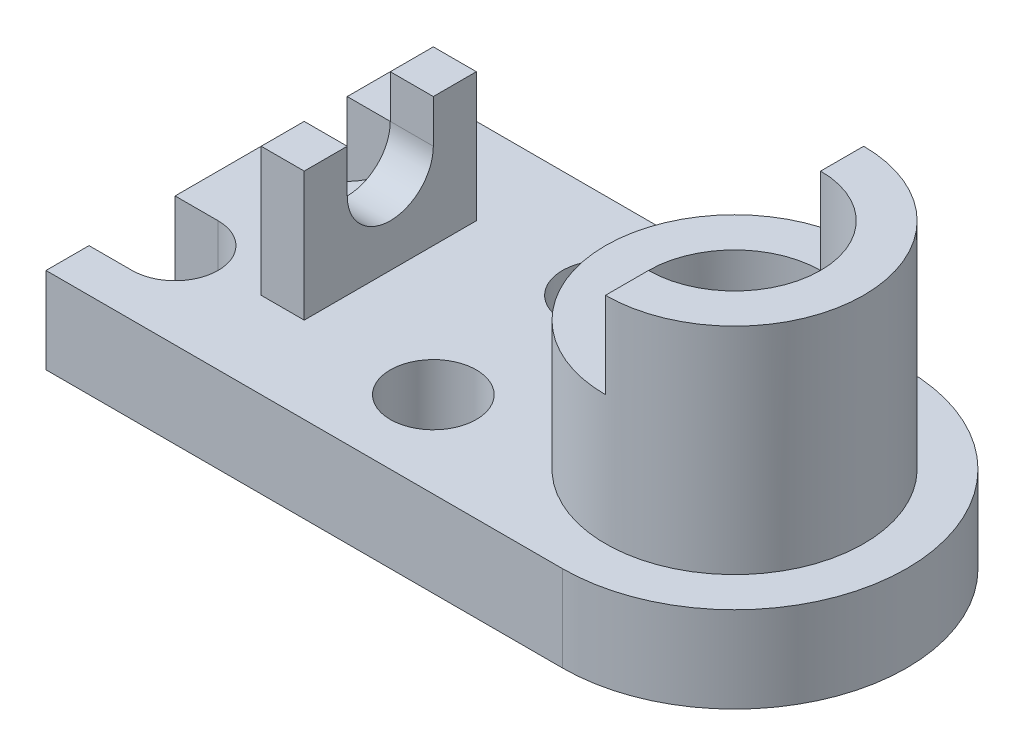
ISO-10303-21;
HEADER;
FILE_DESCRIPTION(('STEP AP214'),'2;1');
FILE_NAME('part.step','',(''),(''),'','','');
FILE_SCHEMA(('AUTOMOTIVE_DESIGN { 1 0 10303 214 1 1 1 1 }'));
ENDSEC;
DATA;
#1=APPLICATION_CONTEXT('core data for automotive mechanical design processes');
#2=APPLICATION_PROTOCOL_DEFINITION('international standard','automotive_design',2000,#1);
#3=PRODUCT_CONTEXT('',#1,'mechanical');
#4=PRODUCT('Part','Part','',(#3));
#5=PRODUCT_RELATED_PRODUCT_CATEGORY('part','',(#4));
#6=PRODUCT_DEFINITION_FORMATION('','',#4);
#7=PRODUCT_DEFINITION_CONTEXT('part definition',#1,'design');
#8=PRODUCT_DEFINITION('design','',#6,#7);
#9=PRODUCT_DEFINITION_SHAPE('','',#8);
#10=(LENGTH_UNIT() NAMED_UNIT(*) SI_UNIT(.MILLI.,.METRE.));
#11=(NAMED_UNIT(*) PLANE_ANGLE_UNIT() SI_UNIT($,.RADIAN.));
#12=(NAMED_UNIT(*) SI_UNIT($,.STERADIAN.) SOLID_ANGLE_UNIT());
#13=UNCERTAINTY_MEASURE_WITH_UNIT(LENGTH_MEASURE(1.E-05),#10,'distance_accuracy_value','');
#14=(GEOMETRIC_REPRESENTATION_CONTEXT(3) GLOBAL_UNCERTAINTY_ASSIGNED_CONTEXT((#13)) GLOBAL_UNIT_ASSIGNED_CONTEXT((#10,
#11,#12)) REPRESENTATION_CONTEXT('',''));
#15=CARTESIAN_POINT('',(0.,0.,0.));
#16=DIRECTION('',(0.,0.,1.));
#17=DIRECTION('',(1.,0.,0.));
#18=AXIS2_PLACEMENT_3D('',#15,#16,#17);
#19=CARTESIAN_POINT('',(0.,50.,0.));
#20=DIRECTION('',(0.,-1.,0.));
#21=DIRECTION('',(0.,0.,-1.));
#22=AXIS2_PLACEMENT_3D('',#19,#20,#21);
#23=PLANE('',#22);
#24=DIRECTION('',(0.,0.,-1.));
#25=VECTOR('',#24,1.);
#26=CARTESIAN_POINT('',(40.,50.,-20.));
#27=LINE('',#26,#25);
#28=CARTESIAN_POINT('',(40.,50.,20.));
#29=VERTEX_POINT('',#28);
#30=CARTESIAN_POINT('',(40.,50.,10.));
#31=VERTEX_POINT('',#30);
#32=EDGE_CURVE('E441',#29,#31,#27,.T.);
#33=ORIENTED_EDGE('',*,*,#32,.T.);
#34=DIRECTION('',(-1.,0.,0.));
#35=VECTOR('',#34,1.);
#36=CARTESIAN_POINT('',(0.,50.,10.));
#37=LINE('',#36,#35);
#38=CARTESIAN_POINT('',(30.,50.,10.));
#39=VERTEX_POINT('',#38);
#40=EDGE_CURVE('E11',#31,#39,#37,.T.);
#41=ORIENTED_EDGE('',*,*,#40,.T.);
#42=DIRECTION('',(0.,0.,1.));
#43=VECTOR('',#42,1.);
#44=CARTESIAN_POINT('',(30.,50.,-20.));
#45=LINE('',#44,#43);
#46=CARTESIAN_POINT('',(30.,50.,20.));
#47=VERTEX_POINT('',#46);
#48=EDGE_CURVE('E216',#39,#47,#45,.T.);
#49=ORIENTED_EDGE('',*,*,#48,.T.);
#50=DIRECTION('',(1.,0.,0.));
#51=VECTOR('',#50,1.);
#52=CARTESIAN_POINT('',(40.,50.,20.));
#53=LINE('',#52,#51);
#54=EDGE_CURVE('E215',#47,#29,#53,.T.);
#55=ORIENTED_EDGE('',*,*,#54,.T.);
#56=EDGE_LOOP('',(#33,#41,#49,#55));
#57=FACE_BOUND('',#56,.T.);
#58=ADVANCED_FACE('F33',(#57),#23,.F.);
#59=CARTESIAN_POINT('',(120.,20.,0.));
#60=DIRECTION('',(0.,-1.,0.));
#61=DIRECTION('',(0.,0.,-1.));
#62=AXIS2_PLACEMENT_3D('',#59,#60,#61);
#63=PLANE('',#62);
#64=CARTESIAN_POINT('',(120.,20.,0.));
#65=DIRECTION('',(0.,-1.,0.));
#66=DIRECTION('',(0.,0.,-1.));
#67=AXIS2_PLACEMENT_3D('',#64,#65,#66);
#68=CIRCLE('',#67,30.);
#69=CARTESIAN_POINT('',(120.,20.,-30.));
#70=VERTEX_POINT('',#69);
#71=EDGE_CURVE('E200',#70,#70,#68,.F.);
#72=ORIENTED_EDGE('',*,*,#71,.F.);
#73=EDGE_LOOP('',(#72));
#74=FACE_BOUND('',#73,.T.);
#75=DIRECTION('',(0.,0.,1.));
#76=VECTOR('',#75,1.);
#77=CARTESIAN_POINT('',(0.,20.,-40.));
#78=LINE('',#77,#76);
#79=CARTESIAN_POINT('',(0.,20.,-10.));
#80=VERTEX_POINT('',#79);
#81=CARTESIAN_POINT('',(0.,20.,10.));
#82=VERTEX_POINT('',#81);
#83=EDGE_CURVE('E384',#80,#82,#78,.T.);
#84=ORIENTED_EDGE('',*,*,#83,.T.);
#85=DIRECTION('',(-1.,0.,0.));
#86=VECTOR('',#85,1.);
#87=CARTESIAN_POINT('',(0.,20.,10.));
#88=LINE('',#87,#86);
#89=CARTESIAN_POINT('',(10.,20.,10.));
#90=VERTEX_POINT('',#89);
#91=EDGE_CURVE('E327',#90,#82,#88,.T.);
#92=ORIENTED_EDGE('',*,*,#91,.F.);
#93=CARTESIAN_POINT('',(10.,20.,20.));
#94=DIRECTION('',(0.,1.,0.));
#95=DIRECTION('',(0.,0.,-1.));
#96=AXIS2_PLACEMENT_3D('',#93,#94,#95);
#97=CIRCLE('',#96,10.);
#98=CARTESIAN_POINT('',(10.,20.,30.));
#99=VERTEX_POINT('',#98);
#100=EDGE_CURVE('E336',#99,#90,#97,.T.);
#101=ORIENTED_EDGE('',*,*,#100,.F.);
#102=DIRECTION('',(1.,0.,0.));
#103=VECTOR('',#102,1.);
#104=CARTESIAN_POINT('',(0.,20.,30.));
#105=LINE('',#104,#103);
#106=CARTESIAN_POINT('',(0.,20.,30.));
#107=VERTEX_POINT('',#106);
#108=EDGE_CURVE('E320',#107,#99,#105,.T.);
#109=ORIENTED_EDGE('',*,*,#108,.F.);
#110=CARTESIAN_POINT('',(0.,20.,40.));
#111=VERTEX_POINT('',#110);
#112=EDGE_CURVE('E378',#107,#111,#78,.T.);
#113=ORIENTED_EDGE('',*,*,#112,.T.);
#114=DIRECTION('',(1.,0.,0.));
#115=VECTOR('',#114,1.);
#116=CARTESIAN_POINT('',(0.,20.,40.));
#117=LINE('',#116,#115);
#118=CARTESIAN_POINT('',(120.,20.,40.));
#119=VERTEX_POINT('',#118);
#120=EDGE_CURVE('E383',#111,#119,#117,.T.);
#121=ORIENTED_EDGE('',*,*,#120,.T.);
#122=CARTESIAN_POINT('',(120.,20.,0.));
#123=DIRECTION('',(0.,1.,0.));
#124=DIRECTION('',(0.,0.,-1.));
#125=AXIS2_PLACEMENT_3D('',#122,#123,#124);
#126=CIRCLE('',#125,40.);
#127=CARTESIAN_POINT('',(120.,20.,-40.));
#128=VERTEX_POINT('',#127);
#129=EDGE_CURVE('E386',#119,#128,#126,.T.);
#130=ORIENTED_EDGE('',*,*,#129,.T.);
#131=DIRECTION('',(-1.,0.,0.));
#132=VECTOR('',#131,1.);
#133=CARTESIAN_POINT('',(0.,20.,-40.));
#134=LINE('',#133,#132);
#135=CARTESIAN_POINT('',(0.,20.,-40.));
#136=VERTEX_POINT('',#135);
#137=EDGE_CURVE('E375',#128,#136,#134,.T.);
#138=ORIENTED_EDGE('',*,*,#137,.T.);
#139=CARTESIAN_POINT('',(0.,20.,-30.));
#140=VERTEX_POINT('',#139);
#141=EDGE_CURVE('E380',#136,#140,#78,.T.);
#142=ORIENTED_EDGE('',*,*,#141,.T.);
#143=DIRECTION('',(-1.,0.,0.));
#144=VECTOR('',#143,1.);
#145=CARTESIAN_POINT('',(0.,20.,-30.));
#146=LINE('',#145,#144);
#147=CARTESIAN_POINT('',(10.,20.,-30.));
#148=VERTEX_POINT('',#147);
#149=EDGE_CURVE('E353',#148,#140,#146,.T.);
#150=ORIENTED_EDGE('',*,*,#149,.F.);
#151=CARTESIAN_POINT('',(10.,20.,-20.));
#152=DIRECTION('',(0.,1.,0.));
#153=DIRECTION('',(0.,0.,-1.));
#154=AXIS2_PLACEMENT_3D('',#151,#152,#153);
#155=CIRCLE('',#154,10.);
#156=CARTESIAN_POINT('',(10.,20.,-10.));
#157=VERTEX_POINT('',#156);
#158=EDGE_CURVE('E362',#157,#148,#155,.T.);
#159=ORIENTED_EDGE('',*,*,#158,.F.);
#160=DIRECTION('',(1.,0.,0.));
#161=VECTOR('',#160,1.);
#162=CARTESIAN_POINT('',(0.,20.,-10.));
#163=LINE('',#162,#161);
#164=EDGE_CURVE('E343',#80,#157,#163,.T.);
#165=ORIENTED_EDGE('',*,*,#164,.F.);
#166=EDGE_LOOP('',(#84,#92,#101,#109,#113,#121,#130,#138,#142,#150,#159,#165));
#167=FACE_BOUND('',#166,.T.);
#168=CARTESIAN_POINT('',(70.,20.,-20.));
#169=DIRECTION('',(0.,1.,0.));
#170=DIRECTION('',(0.,0.,1.));
#171=AXIS2_PLACEMENT_3D('',#168,#169,#170);
#172=CIRCLE('',#171,9.99999999999999);
#173=CARTESIAN_POINT('',(70.,20.,-10.));
#174=VERTEX_POINT('',#173);
#175=EDGE_CURVE('E315',#174,#174,#172,.T.);
#176=ORIENTED_EDGE('',*,*,#175,.F.);
#177=EDGE_LOOP('',(#176));
#178=FACE_BOUND('',#177,.T.);
#179=CARTESIAN_POINT('',(70.,20.,20.));
#180=DIRECTION('',(0.,1.,0.));
#181=DIRECTION('',(0.,0.,1.));
#182=AXIS2_PLACEMENT_3D('',#179,#180,#181);
#183=CIRCLE('',#182,9.99999999999999);
#184=CARTESIAN_POINT('',(70.,20.,30.));
#185=VERTEX_POINT('',#184);
#186=EDGE_CURVE('E299',#185,#185,#183,.T.);
#187=ORIENTED_EDGE('',*,*,#186,.F.);
#188=EDGE_LOOP('',(#187));
#189=FACE_BOUND('',#188,.T.);
#190=DIRECTION('',(0.,0.,-1.));
#191=VECTOR('',#190,1.);
#192=CARTESIAN_POINT('',(40.,20.,-20.));
#193=LINE('',#192,#191);
#194=CARTESIAN_POINT('',(40.,20.,20.));
#195=VERTEX_POINT('',#194);
#196=CARTESIAN_POINT('',(40.,20.,-20.));
#197=VERTEX_POINT('',#196);
#198=EDGE_CURVE('E223',#195,#197,#193,.T.);
#199=ORIENTED_EDGE('',*,*,#198,.F.);
#200=DIRECTION('',(1.,0.,0.));
#201=VECTOR('',#200,1.);
#202=CARTESIAN_POINT('',(40.,20.,20.));
#203=LINE('',#202,#201);
#204=CARTESIAN_POINT('',(30.,20.,20.));
#205=VERTEX_POINT('',#204);
#206=EDGE_CURVE('E231',#205,#195,#203,.T.);
#207=ORIENTED_EDGE('',*,*,#206,.F.);
#208=DIRECTION('',(0.,0.,1.));
#209=VECTOR('',#208,1.);
#210=CARTESIAN_POINT('',(30.,20.,-20.));
#211=LINE('',#210,#209);
#212=CARTESIAN_POINT('',(30.,20.,-20.));
#213=VERTEX_POINT('',#212);
#214=EDGE_CURVE('E228',#213,#205,#211,.T.);
#215=ORIENTED_EDGE('',*,*,#214,.F.);
#216=DIRECTION('',(-1.,0.,0.));
#217=VECTOR('',#216,1.);
#218=CARTESIAN_POINT('',(40.,20.,-20.));
#219=LINE('',#218,#217);
#220=EDGE_CURVE('E56',#197,#213,#219,.T.);
#221=ORIENTED_EDGE('',*,*,#220,.F.);
#222=EDGE_LOOP('',(#199,#207,#215,#221));
#223=FACE_BOUND('',#222,.T.);
#224=ADVANCED_FACE('F416',(#74,#167,#178,#189,#223),#63,.F.);
#225=CARTESIAN_POINT('',(0.,20.,-40.));
#226=DIRECTION('',(1.,0.,0.));
#227=DIRECTION('',(0.,0.,-1.));
#228=AXIS2_PLACEMENT_3D('',#225,#226,#227);
#229=PLANE('',#228);
#230=DIRECTION('',(0.,0.,1.));
#231=VECTOR('',#230,1.);
#232=CARTESIAN_POINT('',(0.,0.,-40.));
#233=LINE('',#232,#231);
#234=CARTESIAN_POINT('',(0.,0.,-10.));
#235=VERTEX_POINT('',#234);
#236=CARTESIAN_POINT('',(0.,0.,10.));
#237=VERTEX_POINT('',#236);
#238=EDGE_CURVE('E396',#235,#237,#233,.T.);
#239=ORIENTED_EDGE('',*,*,#238,.T.);
#240=DIRECTION('',(0.,1.,0.));
#241=VECTOR('',#240,1.);
#242=CARTESIAN_POINT('',(0.,0.,10.));
#243=LINE('',#242,#241);
#244=EDGE_CURVE('E340',#237,#82,#243,.T.);
#245=ORIENTED_EDGE('',*,*,#244,.T.);
#246=ORIENTED_EDGE('',*,*,#83,.F.);
#247=DIRECTION('',(0.,1.,0.));
#248=VECTOR('',#247,1.);
#249=CARTESIAN_POINT('',(0.,0.,-10.));
#250=LINE('',#249,#248);
#251=EDGE_CURVE('E359',#235,#80,#250,.T.);
#252=ORIENTED_EDGE('',*,*,#251,.F.);
#253=EDGE_LOOP('',(#239,#245,#246,#252));
#254=FACE_BOUND('',#253,.T.);
#255=ADVANCED_FACE('F419',(#254),#229,.F.);
#256=CARTESIAN_POINT('',(0.,0.,-40.));
#257=VERTEX_POINT('',#256);
#258=CARTESIAN_POINT('',(0.,0.,-30.));
#259=VERTEX_POINT('',#258);
#260=EDGE_CURVE('E392',#257,#259,#233,.T.);
#261=ORIENTED_EDGE('',*,*,#260,.T.);
#262=DIRECTION('',(0.,1.,0.));
#263=VECTOR('',#262,1.);
#264=CARTESIAN_POINT('',(0.,0.,-30.));
#265=LINE('',#264,#263);
#266=EDGE_CURVE('E366',#259,#140,#265,.T.);
#267=ORIENTED_EDGE('',*,*,#266,.T.);
#268=ORIENTED_EDGE('',*,*,#141,.F.);
#269=DIRECTION('',(0.,-1.,0.));
#270=VECTOR('',#269,1.);
#271=CARTESIAN_POINT('',(0.,20.,-40.));
#272=LINE('',#271,#270);
#273=EDGE_CURVE('E407',#136,#257,#272,.T.);
#274=ORIENTED_EDGE('',*,*,#273,.T.);
#275=EDGE_LOOP('',(#261,#267,#268,#274));
#276=FACE_BOUND('',#275,.T.);
#277=ADVANCED_FACE('F686',(#276),#229,.F.);
#278=CARTESIAN_POINT('',(0.,20.,-40.));
#279=DIRECTION('',(0.,0.,1.));
#280=DIRECTION('',(1.,0.,0.));
#281=AXIS2_PLACEMENT_3D('',#278,#279,#280);
#282=PLANE('',#281);
#283=DIRECTION('',(-1.,0.,0.));
#284=VECTOR('',#283,1.);
#285=CARTESIAN_POINT('',(0.,0.,-40.));
#286=LINE('',#285,#284);
#287=CARTESIAN_POINT('',(120.,0.,-40.));
#288=VERTEX_POINT('',#287);
#289=EDGE_CURVE('E369',#288,#257,#286,.T.);
#290=ORIENTED_EDGE('',*,*,#289,.T.);
#291=ORIENTED_EDGE('',*,*,#273,.F.);
#292=ORIENTED_EDGE('',*,*,#137,.F.);
#293=DIRECTION('',(0.,-1.,0.));
#294=VECTOR('',#293,1.);
#295=CARTESIAN_POINT('',(120.,20.,-40.));
#296=LINE('',#295,#294);
#297=EDGE_CURVE('E388',#128,#288,#296,.T.);
#298=ORIENTED_EDGE('',*,*,#297,.T.);
#299=EDGE_LOOP('',(#290,#291,#292,#298));
#300=FACE_BOUND('',#299,.T.);
#301=ADVANCED_FACE('F35',(#300),#282,.F.);
#302=ORIENTED_EDGE('',*,*,#112,.F.);
#303=DIRECTION('',(0.,1.,0.));
#304=VECTOR('',#303,1.);
#305=CARTESIAN_POINT('',(0.,0.,30.));
#306=LINE('',#305,#304);
#307=CARTESIAN_POINT('',(0.,0.,30.));
#308=VERTEX_POINT('',#307);
#309=EDGE_CURVE('E333',#308,#107,#306,.T.);
#310=ORIENTED_EDGE('',*,*,#309,.F.);
#311=CARTESIAN_POINT('',(0.,0.,40.));
#312=VERTEX_POINT('',#311);
#313=EDGE_CURVE('E391',#308,#312,#233,.T.);
#314=ORIENTED_EDGE('',*,*,#313,.T.);
#315=DIRECTION('',(0.,-1.,0.));
#316=VECTOR('',#315,1.);
#317=CARTESIAN_POINT('',(0.,20.,40.));
#318=LINE('',#317,#316);
#319=EDGE_CURVE('E404',#111,#312,#318,.T.);
#320=ORIENTED_EDGE('',*,*,#319,.F.);
#321=EDGE_LOOP('',(#302,#310,#314,#320));
#322=FACE_BOUND('',#321,.T.);
#323=ADVANCED_FACE('F677',(#322),#229,.F.);
#324=CARTESIAN_POINT('',(0.,20.,40.));
#325=DIRECTION('',(0.,0.,-1.));
#326=DIRECTION('',(-1.,0.,0.));
#327=AXIS2_PLACEMENT_3D('',#324,#325,#326);
#328=PLANE('',#327);
#329=DIRECTION('',(1.,0.,0.));
#330=VECTOR('',#329,1.);
#331=CARTESIAN_POINT('',(0.,0.,40.));
#332=LINE('',#331,#330);
#333=CARTESIAN_POINT('',(120.,0.,40.));
#334=VERTEX_POINT('',#333);
#335=EDGE_CURVE('E395',#312,#334,#332,.T.);
#336=ORIENTED_EDGE('',*,*,#335,.T.);
#337=DIRECTION('',(0.,-1.,0.));
#338=VECTOR('',#337,1.);
#339=CARTESIAN_POINT('',(120.,20.,40.));
#340=LINE('',#339,#338);
#341=EDGE_CURVE('E401',#119,#334,#340,.T.);
#342=ORIENTED_EDGE('',*,*,#341,.F.);
#343=ORIENTED_EDGE('',*,*,#120,.F.);
#344=ORIENTED_EDGE('',*,*,#319,.T.);
#345=EDGE_LOOP('',(#336,#342,#343,#344));
#346=FACE_BOUND('',#345,.T.);
#347=ADVANCED_FACE('F668',(#346),#328,.F.);
#348=CARTESIAN_POINT('',(120.,20.,0.));
#349=DIRECTION('',(0.,-1.,0.));
#350=DIRECTION('',(0.,0.,-1.));
#351=AXIS2_PLACEMENT_3D('',#348,#349,#350);
#352=CYLINDRICAL_SURFACE('',#351,40.);
#353=CARTESIAN_POINT('',(120.,0.,0.));
#354=DIRECTION('',(0.,1.,0.));
#355=DIRECTION('',(0.,0.,-1.));
#356=AXIS2_PLACEMENT_3D('',#353,#354,#355);
#357=CIRCLE('',#356,40.);
#358=EDGE_CURVE('E379',#334,#288,#357,.T.);
#359=ORIENTED_EDGE('',*,*,#358,.T.);
#360=ORIENTED_EDGE('',*,*,#297,.F.);
#361=ORIENTED_EDGE('',*,*,#129,.F.);
#362=ORIENTED_EDGE('',*,*,#341,.T.);
#363=EDGE_LOOP('',(#359,#360,#361,#362));
#364=FACE_BOUND('',#363,.T.);
#365=ADVANCED_FACE('F660',(#364),#352,.T.);
#366=CARTESIAN_POINT('',(120.,0.,0.));
#367=DIRECTION('',(0.,-1.,0.));
#368=DIRECTION('',(0.,0.,-1.));
#369=AXIS2_PLACEMENT_3D('',#366,#367,#368);
#370=PLANE('',#369);
#371=CARTESIAN_POINT('',(120.,0.,0.));
#372=DIRECTION('',(0.,-1.,0.));
#373=DIRECTION('',(0.,0.,-1.));
#374=AXIS2_PLACEMENT_3D('',#371,#372,#373);
#375=CIRCLE('',#374,10.);
#376=CARTESIAN_POINT('',(120.,0.,-10.));
#377=VERTEX_POINT('',#376);
#378=EDGE_CURVE('E310',#377,#377,#375,.T.);
#379=ORIENTED_EDGE('',*,*,#378,.F.);
#380=EDGE_LOOP('',(#379));
#381=FACE_BOUND('',#380,.T.);
#382=CARTESIAN_POINT('',(70.,0.,20.));
#383=DIRECTION('',(0.,1.,0.));
#384=DIRECTION('',(0.,0.,1.));
#385=AXIS2_PLACEMENT_3D('',#382,#383,#384);
#386=CIRCLE('',#385,9.99999999999999);
#387=CARTESIAN_POINT('',(70.,0.,30.));
#388=VERTEX_POINT('',#387);
#389=EDGE_CURVE('E302',#388,#388,#386,.T.);
#390=ORIENTED_EDGE('',*,*,#389,.T.);
#391=EDGE_LOOP('',(#390));
#392=FACE_BOUND('',#391,.T.);
#393=CARTESIAN_POINT('',(70.,0.,-20.));
#394=DIRECTION('',(0.,1.,0.));
#395=DIRECTION('',(0.,0.,1.));
#396=AXIS2_PLACEMENT_3D('',#393,#394,#395);
#397=CIRCLE('',#396,9.99999999999999);
#398=CARTESIAN_POINT('',(70.,0.,-10.));
#399=VERTEX_POINT('',#398);
#400=EDGE_CURVE('E317',#399,#399,#397,.T.);
#401=ORIENTED_EDGE('',*,*,#400,.T.);
#402=EDGE_LOOP('',(#401));
#403=FACE_BOUND('',#402,.T.);
#404=DIRECTION('',(-1.,0.,0.));
#405=VECTOR('',#404,1.);
#406=CARTESIAN_POINT('',(0.,0.,10.));
#407=LINE('',#406,#405);
#408=CARTESIAN_POINT('',(10.,0.,10.));
#409=VERTEX_POINT('',#408);
#410=EDGE_CURVE('E330',#409,#237,#407,.T.);
#411=ORIENTED_EDGE('',*,*,#410,.T.);
#412=ORIENTED_EDGE('',*,*,#238,.F.);
#413=DIRECTION('',(1.,0.,0.));
#414=VECTOR('',#413,1.);
#415=CARTESIAN_POINT('',(0.,0.,-10.));
#416=LINE('',#415,#414);
#417=CARTESIAN_POINT('',(9.99999999999999,0.,-10.));
#418=VERTEX_POINT('',#417);
#419=EDGE_CURVE('E349',#235,#418,#416,.T.);
#420=ORIENTED_EDGE('',*,*,#419,.T.);
#421=CARTESIAN_POINT('',(10.,0.,-20.));
#422=DIRECTION('',(0.,1.,0.));
#423=DIRECTION('',(0.,0.,-1.));
#424=AXIS2_PLACEMENT_3D('',#421,#422,#423);
#425=CIRCLE('',#424,10.);
#426=CARTESIAN_POINT('',(10.,0.,-30.));
#427=VERTEX_POINT('',#426);
#428=EDGE_CURVE('E352',#418,#427,#425,.T.);
#429=ORIENTED_EDGE('',*,*,#428,.T.);
#430=DIRECTION('',(-1.,0.,0.));
#431=VECTOR('',#430,1.);
#432=CARTESIAN_POINT('',(0.,0.,-30.));
#433=LINE('',#432,#431);
#434=EDGE_CURVE('E356',#427,#259,#433,.T.);
#435=ORIENTED_EDGE('',*,*,#434,.T.);
#436=ORIENTED_EDGE('',*,*,#260,.F.);
#437=ORIENTED_EDGE('',*,*,#289,.F.);
#438=ORIENTED_EDGE('',*,*,#358,.F.);
#439=ORIENTED_EDGE('',*,*,#335,.F.);
#440=ORIENTED_EDGE('',*,*,#313,.F.);
#441=DIRECTION('',(1.,0.,0.));
#442=VECTOR('',#441,1.);
#443=CARTESIAN_POINT('',(0.,0.,30.));
#444=LINE('',#443,#442);
#445=CARTESIAN_POINT('',(9.99999999999999,0.,30.));
#446=VERTEX_POINT('',#445);
#447=EDGE_CURVE('E323',#308,#446,#444,.T.);
#448=ORIENTED_EDGE('',*,*,#447,.T.);
#449=CARTESIAN_POINT('',(10.,0.,20.));
#450=DIRECTION('',(0.,1.,0.));
#451=DIRECTION('',(0.,0.,-1.));
#452=AXIS2_PLACEMENT_3D('',#449,#450,#451);
#453=CIRCLE('',#452,10.);
#454=EDGE_CURVE('E326',#446,#409,#453,.T.);
#455=ORIENTED_EDGE('',*,*,#454,.T.);
#456=EDGE_LOOP('',(#411,#412,#420,#429,#435,#436,#437,#438,#439,#440,#448,#455));
#457=FACE_BOUND('',#456,.T.);
#458=ADVANCED_FACE('F652',(#381,#392,#403,#457),#370,.T.);
#459=CARTESIAN_POINT('',(0.,0.,-30.));
#460=DIRECTION('',(0.,0.,-1.));
#461=DIRECTION('',(-1.,0.,0.));
#462=AXIS2_PLACEMENT_3D('',#459,#460,#461);
#463=PLANE('',#462);
#464=ORIENTED_EDGE('',*,*,#149,.T.);
#465=ORIENTED_EDGE('',*,*,#266,.F.);
#466=ORIENTED_EDGE('',*,*,#434,.F.);
#467=DIRECTION('',(0.,1.,0.));
#468=VECTOR('',#467,1.);
#469=CARTESIAN_POINT('',(10.,0.,-30.));
#470=LINE('',#469,#468);
#471=EDGE_CURVE('E370',#427,#148,#470,.T.);
#472=ORIENTED_EDGE('',*,*,#471,.T.);
#473=EDGE_LOOP('',(#464,#465,#466,#472));
#474=FACE_BOUND('',#473,.T.);
#475=ADVANCED_FACE('F644',(#474),#463,.F.);
#476=CARTESIAN_POINT('',(10.,0.,-20.));
#477=DIRECTION('',(0.,1.,0.));
#478=DIRECTION('',(0.,0.,1.));
#479=AXIS2_PLACEMENT_3D('',#476,#477,#478);
#480=CYLINDRICAL_SURFACE('',#479,10.);
#481=ORIENTED_EDGE('',*,*,#158,.T.);
#482=ORIENTED_EDGE('',*,*,#471,.F.);
#483=ORIENTED_EDGE('',*,*,#428,.F.);
#484=DIRECTION('',(0.,1.,0.));
#485=VECTOR('',#484,1.);
#486=CARTESIAN_POINT('',(10.,0.,-10.));
#487=LINE('',#486,#485);
#488=EDGE_CURVE('E372',#418,#157,#487,.T.);
#489=ORIENTED_EDGE('',*,*,#488,.T.);
#490=EDGE_LOOP('',(#481,#482,#483,#489));
#491=FACE_BOUND('',#490,.T.);
#492=ADVANCED_FACE('F636',(#491),#480,.F.);
#493=CARTESIAN_POINT('',(0.,0.,-10.));
#494=DIRECTION('',(0.,0.,1.));
#495=DIRECTION('',(1.,0.,0.));
#496=AXIS2_PLACEMENT_3D('',#493,#494,#495);
#497=PLANE('',#496);
#498=ORIENTED_EDGE('',*,*,#164,.T.);
#499=ORIENTED_EDGE('',*,*,#488,.F.);
#500=ORIENTED_EDGE('',*,*,#419,.F.);
#501=ORIENTED_EDGE('',*,*,#251,.T.);
#502=EDGE_LOOP('',(#498,#499,#500,#501));
#503=FACE_BOUND('',#502,.T.);
#504=ADVANCED_FACE('F628',(#503),#497,.F.);
#505=CARTESIAN_POINT('',(0.,0.,10.));
#506=DIRECTION('',(0.,0.,-1.));
#507=DIRECTION('',(-1.,0.,0.));
#508=AXIS2_PLACEMENT_3D('',#505,#506,#507);
#509=PLANE('',#508);
#510=ORIENTED_EDGE('',*,*,#91,.T.);
#511=ORIENTED_EDGE('',*,*,#244,.F.);
#512=ORIENTED_EDGE('',*,*,#410,.F.);
#513=DIRECTION('',(0.,1.,0.));
#514=VECTOR('',#513,1.);
#515=CARTESIAN_POINT('',(10.,0.,10.));
#516=LINE('',#515,#514);
#517=EDGE_CURVE('E344',#409,#90,#516,.T.);
#518=ORIENTED_EDGE('',*,*,#517,.T.);
#519=EDGE_LOOP('',(#510,#511,#512,#518));
#520=FACE_BOUND('',#519,.T.);
#521=ADVANCED_FACE('F620',(#520),#509,.F.);
#522=CARTESIAN_POINT('',(10.,0.,20.));
#523=DIRECTION('',(0.,1.,0.));
#524=DIRECTION('',(0.,0.,1.));
#525=AXIS2_PLACEMENT_3D('',#522,#523,#524);
#526=CYLINDRICAL_SURFACE('',#525,10.);
#527=ORIENTED_EDGE('',*,*,#100,.T.);
#528=ORIENTED_EDGE('',*,*,#517,.F.);
#529=ORIENTED_EDGE('',*,*,#454,.F.);
#530=DIRECTION('',(0.,1.,0.));
#531=VECTOR('',#530,1.);
#532=CARTESIAN_POINT('',(10.,0.,30.));
#533=LINE('',#532,#531);
#534=EDGE_CURVE('E346',#446,#99,#533,.T.);
#535=ORIENTED_EDGE('',*,*,#534,.T.);
#536=EDGE_LOOP('',(#527,#528,#529,#535));
#537=FACE_BOUND('',#536,.T.);
#538=ADVANCED_FACE('F612',(#537),#526,.F.);
#539=CARTESIAN_POINT('',(0.,0.,30.));
#540=DIRECTION('',(0.,0.,1.));
#541=DIRECTION('',(1.,0.,0.));
#542=AXIS2_PLACEMENT_3D('',#539,#540,#541);
#543=PLANE('',#542);
#544=ORIENTED_EDGE('',*,*,#108,.T.);
#545=ORIENTED_EDGE('',*,*,#534,.F.);
#546=ORIENTED_EDGE('',*,*,#447,.F.);
#547=ORIENTED_EDGE('',*,*,#309,.T.);
#548=EDGE_LOOP('',(#544,#545,#546,#547));
#549=FACE_BOUND('',#548,.T.);
#550=ADVANCED_FACE('F604',(#549),#543,.F.);
#551=CARTESIAN_POINT('',(70.,0.,-20.));
#552=DIRECTION('',(0.,1.,0.));
#553=DIRECTION('',(0.,0.,1.));
#554=AXIS2_PLACEMENT_3D('',#551,#552,#553);
#555=CYLINDRICAL_SURFACE('',#554,9.99999999999999);
#556=ORIENTED_EDGE('',*,*,#400,.F.);
#557=EDGE_LOOP('',(#556));
#558=FACE_BOUND('',#557,.T.);
#559=ORIENTED_EDGE('',*,*,#175,.T.);
#560=EDGE_LOOP('',(#559));
#561=FACE_BOUND('',#560,.T.);
#562=ADVANCED_FACE('F596',(#558,#561),#555,.F.);
#563=CARTESIAN_POINT('',(70.,0.,20.));
#564=DIRECTION('',(0.,1.,0.));
#565=DIRECTION('',(0.,0.,1.));
#566=AXIS2_PLACEMENT_3D('',#563,#564,#565);
#567=CYLINDRICAL_SURFACE('',#566,9.99999999999999);
#568=ORIENTED_EDGE('',*,*,#389,.F.);
#569=EDGE_LOOP('',(#568));
#570=FACE_BOUND('',#569,.T.);
#571=ORIENTED_EDGE('',*,*,#186,.T.);
#572=EDGE_LOOP('',(#571));
#573=FACE_BOUND('',#572,.T.);
#574=ADVANCED_FACE('F589',(#570,#573),#567,.F.);
#575=CARTESIAN_POINT('',(120.,50.,0.));
#576=DIRECTION('',(0.,-1.,0.));
#577=DIRECTION('',(0.,0.,-1.));
#578=AXIS2_PLACEMENT_3D('',#575,#576,#577);
#579=CYLINDRICAL_SURFACE('',#578,30.);
#580=CARTESIAN_POINT('',(120.,50.,0.));
#581=DIRECTION('',(0.,1.,0.));
#582=DIRECTION('',(0.,0.,1.));
#583=AXIS2_PLACEMENT_3D('',#580,#581,#582);
#584=CIRCLE('',#583,30.);
#585=CARTESIAN_POINT('',(120.,50.,-30.));
#586=VERTEX_POINT('',#585);
#587=CARTESIAN_POINT('',(120.,50.,30.));
#588=VERTEX_POINT('',#587);
#589=EDGE_CURVE('E264',#586,#588,#584,.T.);
#590=ORIENTED_EDGE('',*,*,#589,.F.);
#591=DIRECTION('',(0.,-1.,0.));
#592=VECTOR('',#591,1.);
#593=CARTESIAN_POINT('',(120.,70.,-30.));
#594=LINE('',#593,#592);
#595=CARTESIAN_POINT('',(120.,70.,-30.));
#596=VERTEX_POINT('',#595);
#597=EDGE_CURVE('E270',#596,#586,#594,.T.);
#598=ORIENTED_EDGE('',*,*,#597,.F.);
#599=CARTESIAN_POINT('',(120.,70.,0.));
#600=DIRECTION('',(0.,1.,0.));
#601=DIRECTION('',(0.,0.,-1.));
#602=AXIS2_PLACEMENT_3D('',#599,#600,#601);
#603=CIRCLE('',#602,30.);
#604=CARTESIAN_POINT('',(120.,70.,30.));
#605=VERTEX_POINT('',#604);
#606=EDGE_CURVE('E251',#605,#596,#603,.T.);
#607=ORIENTED_EDGE('',*,*,#606,.F.);
#608=DIRECTION('',(0.,-1.,0.));
#609=VECTOR('',#608,1.);
#610=CARTESIAN_POINT('',(120.,70.,30.));
#611=LINE('',#610,#609);
#612=EDGE_CURVE('E266',#605,#588,#611,.T.);
#613=ORIENTED_EDGE('',*,*,#612,.T.);
#614=EDGE_LOOP('',(#590,#598,#607,#613));
#615=FACE_BOUND('',#614,.T.);
#616=ORIENTED_EDGE('',*,*,#71,.T.);
#617=EDGE_LOOP('',(#616));
#618=FACE_BOUND('',#617,.T.);
#619=ADVANCED_FACE('F295',(#615,#618),#579,.T.);
#620=CARTESIAN_POINT('',(120.,50.,0.));
#621=DIRECTION('',(0.,1.,0.));
#622=DIRECTION('',(0.,0.,1.));
#623=AXIS2_PLACEMENT_3D('',#620,#621,#622);
#624=PLANE('',#623);
#625=DIRECTION('',(0.,0.,1.));
#626=VECTOR('',#625,1.);
#627=CARTESIAN_POINT('',(120.,50.,-20.));
#628=LINE('',#627,#626);
#629=CARTESIAN_POINT('',(120.,50.,-20.));
#630=VERTEX_POINT('',#629);
#631=EDGE_CURVE('E249',#586,#630,#628,.T.);
#632=ORIENTED_EDGE('',*,*,#631,.F.);
#633=ORIENTED_EDGE('',*,*,#589,.T.);
#634=DIRECTION('',(0.,0.,1.));
#635=VECTOR('',#634,1.);
#636=CARTESIAN_POINT('',(120.,50.,20.));
#637=LINE('',#636,#635);
#638=CARTESIAN_POINT('',(120.,50.,20.));
#639=VERTEX_POINT('',#638);
#640=EDGE_CURVE('E244',#639,#588,#637,.T.);
#641=ORIENTED_EDGE('',*,*,#640,.F.);
#642=CARTESIAN_POINT('',(120.,50.,0.));
#643=DIRECTION('',(0.,1.,0.));
#644=DIRECTION('',(0.,0.,1.));
#645=AXIS2_PLACEMENT_3D('',#642,#643,#644);
#646=CIRCLE('',#645,20.);
#647=EDGE_CURVE('E305',#630,#639,#646,.T.);
#648=ORIENTED_EDGE('',*,*,#647,.F.);
#649=EDGE_LOOP('',(#632,#633,#641,#648));
#650=FACE_BOUND('',#649,.T.);
#651=ADVANCED_FACE('F576',(#650),#624,.T.);
#652=CARTESIAN_POINT('',(120.,40.,0.));
#653=DIRECTION('',(0.,1.,0.));
#654=DIRECTION('',(0.,0.,1.));
#655=AXIS2_PLACEMENT_3D('',#652,#653,#654);
#656=CYLINDRICAL_SURFACE('',#655,20.);
#657=CARTESIAN_POINT('',(120.,40.,0.));
#658=DIRECTION('',(0.,1.,0.));
#659=DIRECTION('',(0.,0.,1.));
#660=AXIS2_PLACEMENT_3D('',#657,#658,#659);
#661=CIRCLE('',#660,20.);
#662=CARTESIAN_POINT('',(120.,40.,20.));
#663=VERTEX_POINT('',#662);
#664=EDGE_CURVE('E300',#663,#663,#661,.T.);
#665=ORIENTED_EDGE('',*,*,#664,.F.);
#666=EDGE_LOOP('',(#665));
#667=FACE_BOUND('',#666,.T.);
#668=ORIENTED_EDGE('',*,*,#647,.T.);
#669=DIRECTION('',(0.,-1.,0.));
#670=VECTOR('',#669,1.);
#671=CARTESIAN_POINT('',(120.,70.,20.));
#672=LINE('',#671,#670);
#673=CARTESIAN_POINT('',(120.,70.,20.));
#674=VERTEX_POINT('',#673);
#675=EDGE_CURVE('E269',#674,#639,#672,.T.);
#676=ORIENTED_EDGE('',*,*,#675,.F.);
#677=CARTESIAN_POINT('',(120.,70.,0.));
#678=DIRECTION('',(0.,-1.,0.));
#679=DIRECTION('',(0.,0.,-1.));
#680=AXIS2_PLACEMENT_3D('',#677,#678,#679);
#681=CIRCLE('',#680,20.);
#682=CARTESIAN_POINT('',(120.,70.,-20.));
#683=VERTEX_POINT('',#682);
#684=EDGE_CURVE('E245',#683,#674,#681,.T.);
#685=ORIENTED_EDGE('',*,*,#684,.F.);
#686=DIRECTION('',(0.,-1.,0.));
#687=VECTOR('',#686,1.);
#688=CARTESIAN_POINT('',(120.,70.,-20.));
#689=LINE('',#688,#687);
#690=EDGE_CURVE('E255',#683,#630,#689,.T.);
#691=ORIENTED_EDGE('',*,*,#690,.T.);
#692=EDGE_LOOP('',(#668,#676,#685,#691));
#693=FACE_BOUND('',#692,.T.);
#694=ADVANCED_FACE('F568',(#667,#693),#656,.F.);
#695=CARTESIAN_POINT('',(120.,40.,0.));
#696=DIRECTION('',(0.,1.,0.));
#697=DIRECTION('',(0.,0.,1.));
#698=AXIS2_PLACEMENT_3D('',#695,#696,#697);
#699=PLANE('',#698);
#700=CARTESIAN_POINT('',(120.,40.,0.));
#701=DIRECTION('',(0.,1.,0.));
#702=DIRECTION('',(0.,0.,1.));
#703=AXIS2_PLACEMENT_3D('',#700,#701,#702);
#704=CIRCLE('',#703,10.);
#705=CARTESIAN_POINT('',(120.,40.,10.));
#706=VERTEX_POINT('',#705);
#707=EDGE_CURVE('E275',#706,#706,#704,.T.);
#708=ORIENTED_EDGE('',*,*,#707,.F.);
#709=EDGE_LOOP('',(#708));
#710=FACE_BOUND('',#709,.T.);
#711=ORIENTED_EDGE('',*,*,#664,.T.);
#712=EDGE_LOOP('',(#711));
#713=FACE_BOUND('',#712,.T.);
#714=ADVANCED_FACE('F559',(#710,#713),#699,.T.);
#715=CARTESIAN_POINT('',(120.,-32.,0.));
#716=DIRECTION('',(0.,1.,0.));
#717=DIRECTION('',(0.,0.,1.));
#718=AXIS2_PLACEMENT_3D('',#715,#716,#717);
#719=CYLINDRICAL_SURFACE('',#718,10.);
#720=ORIENTED_EDGE('',*,*,#378,.T.);
#721=EDGE_LOOP('',(#720));
#722=FACE_BOUND('',#721,.T.);
#723=ORIENTED_EDGE('',*,*,#707,.T.);
#724=EDGE_LOOP('',(#723));
#725=FACE_BOUND('',#724,.T.);
#726=ADVANCED_FACE('F550',(#722,#725),#719,.F.);
#727=CARTESIAN_POINT('',(120.,70.,20.));
#728=DIRECTION('',(1.,0.,0.));
#729=DIRECTION('',(0.,0.,-1.));
#730=AXIS2_PLACEMENT_3D('',#727,#728,#729);
#731=PLANE('',#730);
#732=ORIENTED_EDGE('',*,*,#640,.T.);
#733=ORIENTED_EDGE('',*,*,#612,.F.);
#734=DIRECTION('',(0.,0.,1.));
#735=VECTOR('',#734,1.);
#736=CARTESIAN_POINT('',(120.,70.,20.));
#737=LINE('',#736,#735);
#738=EDGE_CURVE('E248',#674,#605,#737,.T.);
#739=ORIENTED_EDGE('',*,*,#738,.F.);
#740=ORIENTED_EDGE('',*,*,#675,.T.);
#741=EDGE_LOOP('',(#732,#733,#739,#740));
#742=FACE_BOUND('',#741,.T.);
#743=ADVANCED_FACE('F543',(#742),#731,.F.);
#744=CARTESIAN_POINT('',(120.,70.,-20.));
#745=DIRECTION('',(1.,0.,0.));
#746=DIRECTION('',(0.,0.,-1.));
#747=AXIS2_PLACEMENT_3D('',#744,#745,#746);
#748=PLANE('',#747);
#749=ORIENTED_EDGE('',*,*,#631,.T.);
#750=ORIENTED_EDGE('',*,*,#690,.F.);
#751=DIRECTION('',(0.,0.,1.));
#752=VECTOR('',#751,1.);
#753=CARTESIAN_POINT('',(120.,70.,-20.));
#754=LINE('',#753,#752);
#755=EDGE_CURVE('E253',#596,#683,#754,.T.);
#756=ORIENTED_EDGE('',*,*,#755,.F.);
#757=ORIENTED_EDGE('',*,*,#597,.T.);
#758=EDGE_LOOP('',(#749,#750,#756,#757));
#759=FACE_BOUND('',#758,.T.);
#760=ADVANCED_FACE('F290',(#759),#748,.F.);
#761=CARTESIAN_POINT('',(120.,70.,0.));
#762=DIRECTION('',(0.,-1.,0.));
#763=DIRECTION('',(0.,0.,-1.));
#764=AXIS2_PLACEMENT_3D('',#761,#762,#763);
#765=PLANE('',#764);
#766=ORIENTED_EDGE('',*,*,#684,.T.);
#767=ORIENTED_EDGE('',*,*,#738,.T.);
#768=ORIENTED_EDGE('',*,*,#606,.T.);
#769=ORIENTED_EDGE('',*,*,#755,.T.);
#770=EDGE_LOOP('',(#766,#767,#768,#769));
#771=FACE_BOUND('',#770,.T.);
#772=ADVANCED_FACE('F468',(#771),#765,.F.);
#773=CARTESIAN_POINT('',(40.,50.,-20.));
#774=DIRECTION('',(-1.,0.,0.));
#775=DIRECTION('',(0.,0.,1.));
#776=AXIS2_PLACEMENT_3D('',#773,#774,#775);
#777=PLANE('',#776);
#778=CARTESIAN_POINT('',(40.,40.,0.));
#779=DIRECTION('',(-1.,0.,0.));
#780=DIRECTION('',(0.,0.,1.));
#781=AXIS2_PLACEMENT_3D('',#778,#779,#780);
#782=CIRCLE('',#781,10.);
#783=CARTESIAN_POINT('',(40.,40.,-10.));
#784=VERTEX_POINT('',#783);
#785=CARTESIAN_POINT('',(40.,40.,10.));
#786=VERTEX_POINT('',#785);
#787=EDGE_CURVE('E226',#784,#786,#782,.T.);
#788=ORIENTED_EDGE('',*,*,#787,.T.);
#789=DIRECTION('',(0.,1.,0.));
#790=VECTOR('',#789,1.);
#791=CARTESIAN_POINT('',(40.,50.,10.));
#792=LINE('',#791,#790);
#793=EDGE_CURVE('E442',#786,#31,#792,.T.);
#794=ORIENTED_EDGE('',*,*,#793,.T.);
#795=ORIENTED_EDGE('',*,*,#32,.F.);
#796=DIRECTION('',(0.,-1.,0.));
#797=VECTOR('',#796,1.);
#798=CARTESIAN_POINT('',(40.,50.,20.));
#799=LINE('',#798,#797);
#800=EDGE_CURVE('E218',#29,#195,#799,.T.);
#801=ORIENTED_EDGE('',*,*,#800,.T.);
#802=ORIENTED_EDGE('',*,*,#198,.T.);
#803=DIRECTION('',(0.,-1.,0.));
#804=VECTOR('',#803,1.);
#805=CARTESIAN_POINT('',(40.,50.,-20.));
#806=LINE('',#805,#804);
#807=CARTESIAN_POINT('',(40.,50.,-20.));
#808=VERTEX_POINT('',#807);
#809=EDGE_CURVE('E242',#808,#197,#806,.T.);
#810=ORIENTED_EDGE('',*,*,#809,.F.);
#811=CARTESIAN_POINT('',(40.,50.,-10.));
#812=VERTEX_POINT('',#811);
#813=EDGE_CURVE('E234',#812,#808,#27,.T.);
#814=ORIENTED_EDGE('',*,*,#813,.F.);
#815=DIRECTION('',(0.,-1.,0.));
#816=VECTOR('',#815,1.);
#817=CARTESIAN_POINT('',(40.,50.,-10.));
#818=LINE('',#817,#816);
#819=EDGE_CURVE('E48',#812,#784,#818,.T.);
#820=ORIENTED_EDGE('',*,*,#819,.T.);
#821=EDGE_LOOP('',(#788,#794,#795,#801,#802,#810,#814,#820));
#822=FACE_BOUND('',#821,.T.);
#823=ADVANCED_FACE('F438',(#822),#777,.F.);
#824=CARTESIAN_POINT('',(40.,50.,-20.));
#825=DIRECTION('',(0.,0.,1.));
#826=DIRECTION('',(1.,0.,0.));
#827=AXIS2_PLACEMENT_3D('',#824,#825,#826);
#828=PLANE('',#827);
#829=ORIENTED_EDGE('',*,*,#220,.T.);
#830=DIRECTION('',(0.,-1.,0.));
#831=VECTOR('',#830,1.);
#832=CARTESIAN_POINT('',(30.,50.,-20.));
#833=LINE('',#832,#831);
#834=CARTESIAN_POINT('',(30.,50.,-20.));
#835=VERTEX_POINT('',#834);
#836=EDGE_CURVE('E240',#835,#213,#833,.T.);
#837=ORIENTED_EDGE('',*,*,#836,.F.);
#838=DIRECTION('',(-1.,0.,0.));
#839=VECTOR('',#838,1.);
#840=CARTESIAN_POINT('',(40.,50.,-20.));
#841=LINE('',#840,#839);
#842=EDGE_CURVE('E213',#808,#835,#841,.T.);
#843=ORIENTED_EDGE('',*,*,#842,.F.);
#844=ORIENTED_EDGE('',*,*,#809,.T.);
#845=EDGE_LOOP('',(#829,#837,#843,#844));
#846=FACE_BOUND('',#845,.T.);
#847=ADVANCED_FACE('F460',(#846),#828,.F.);
#848=CARTESIAN_POINT('',(30.,50.,-20.));
#849=DIRECTION('',(1.,0.,0.));
#850=DIRECTION('',(0.,0.,-1.));
#851=AXIS2_PLACEMENT_3D('',#848,#849,#850);
#852=PLANE('',#851);
#853=ORIENTED_EDGE('',*,*,#48,.F.);
#854=DIRECTION('',(0.,1.,0.));
#855=VECTOR('',#854,1.);
#856=CARTESIAN_POINT('',(30.,50.,10.));
#857=LINE('',#856,#855);
#858=CARTESIAN_POINT('',(30.,40.,10.));
#859=VERTEX_POINT('',#858);
#860=EDGE_CURVE('E451',#859,#39,#857,.T.);
#861=ORIENTED_EDGE('',*,*,#860,.F.);
#862=CARTESIAN_POINT('',(30.,40.,0.));
#863=DIRECTION('',(-1.,0.,0.));
#864=DIRECTION('',(0.,0.,1.));
#865=AXIS2_PLACEMENT_3D('',#862,#863,#864);
#866=CIRCLE('',#865,10.);
#867=CARTESIAN_POINT('',(30.,40.,-10.));
#868=VERTEX_POINT('',#867);
#869=EDGE_CURVE('E209',#868,#859,#866,.T.);
#870=ORIENTED_EDGE('',*,*,#869,.F.);
#871=DIRECTION('',(0.,-1.,0.));
#872=VECTOR('',#871,1.);
#873=CARTESIAN_POINT('',(30.,50.,-10.));
#874=LINE('',#873,#872);
#875=CARTESIAN_POINT('',(30.,50.,-10.));
#876=VERTEX_POINT('',#875);
#877=EDGE_CURVE('E195',#876,#868,#874,.T.);
#878=ORIENTED_EDGE('',*,*,#877,.F.);
#879=EDGE_CURVE('E206',#835,#876,#45,.T.);
#880=ORIENTED_EDGE('',*,*,#879,.F.);
#881=ORIENTED_EDGE('',*,*,#836,.T.);
#882=ORIENTED_EDGE('',*,*,#214,.T.);
#883=DIRECTION('',(0.,-1.,0.));
#884=VECTOR('',#883,1.);
#885=CARTESIAN_POINT('',(30.,50.,20.));
#886=LINE('',#885,#884);
#887=EDGE_CURVE('E237',#47,#205,#886,.T.);
#888=ORIENTED_EDGE('',*,*,#887,.F.);
#889=EDGE_LOOP('',(#853,#861,#870,#878,#880,#881,#882,#888));
#890=FACE_BOUND('',#889,.T.);
#891=ADVANCED_FACE('F204',(#890),#852,.F.);
#892=CARTESIAN_POINT('',(40.,50.,20.));
#893=DIRECTION('',(0.,0.,-1.));
#894=DIRECTION('',(-1.,0.,0.));
#895=AXIS2_PLACEMENT_3D('',#892,#893,#894);
#896=PLANE('',#895);
#897=ORIENTED_EDGE('',*,*,#206,.T.);
#898=ORIENTED_EDGE('',*,*,#800,.F.);
#899=ORIENTED_EDGE('',*,*,#54,.F.);
#900=ORIENTED_EDGE('',*,*,#887,.T.);
#901=EDGE_LOOP('',(#897,#898,#899,#900));
#902=FACE_BOUND('',#901,.T.);
#903=ADVANCED_FACE('F433',(#902),#896,.F.);
#904=ORIENTED_EDGE('',*,*,#879,.T.);
#905=DIRECTION('',(1.,0.,0.));
#906=VECTOR('',#905,1.);
#907=CARTESIAN_POINT('',(0.,50.,-10.));
#908=LINE('',#907,#906);
#909=EDGE_CURVE('E41',#876,#812,#908,.T.);
#910=ORIENTED_EDGE('',*,*,#909,.T.);
#911=ORIENTED_EDGE('',*,*,#813,.T.);
#912=ORIENTED_EDGE('',*,*,#842,.T.);
#913=EDGE_LOOP('',(#904,#910,#911,#912));
#914=FACE_BOUND('',#913,.T.);
#915=ADVANCED_FACE('F211',(#914),#23,.F.);
#916=CARTESIAN_POINT('',(60.,40.,0.));
#917=DIRECTION('',(-1.,0.,0.));
#918=DIRECTION('',(0.,0.,1.));
#919=AXIS2_PLACEMENT_3D('',#916,#917,#918);
#920=CYLINDRICAL_SURFACE('',#919,10.);
#921=DIRECTION('',(-1.,0.,0.));
#922=VECTOR('',#921,1.);
#923=CARTESIAN_POINT('',(60.,40.,-10.));
#924=LINE('',#923,#922);
#925=EDGE_CURVE('E449',#784,#868,#924,.T.);
#926=ORIENTED_EDGE('',*,*,#925,.T.);
#927=ORIENTED_EDGE('',*,*,#869,.T.);
#928=DIRECTION('',(-1.,0.,0.));
#929=VECTOR('',#928,1.);
#930=CARTESIAN_POINT('',(60.,40.,10.));
#931=LINE('',#930,#929);
#932=EDGE_CURVE('E448',#786,#859,#931,.T.);
#933=ORIENTED_EDGE('',*,*,#932,.F.);
#934=ORIENTED_EDGE('',*,*,#787,.F.);
#935=EDGE_LOOP('',(#926,#927,#933,#934));
#936=FACE_BOUND('',#935,.T.);
#937=ADVANCED_FACE('F456',(#936),#920,.F.);
#938=CARTESIAN_POINT('',(60.,50.,10.));
#939=DIRECTION('',(0.,0.,1.));
#940=DIRECTION('',(0.,-1.,0.));
#941=AXIS2_PLACEMENT_3D('',#938,#939,#940);
#942=PLANE('',#941);
#943=ORIENTED_EDGE('',*,*,#932,.T.);
#944=ORIENTED_EDGE('',*,*,#860,.T.);
#945=ORIENTED_EDGE('',*,*,#40,.F.);
#946=ORIENTED_EDGE('',*,*,#793,.F.);
#947=EDGE_LOOP('',(#943,#944,#945,#946));
#948=FACE_BOUND('',#947,.T.);
#949=ADVANCED_FACE('F458',(#948),#942,.F.);
#950=CARTESIAN_POINT('',(60.,50.,-10.));
#951=DIRECTION('',(0.,0.,-1.));
#952=DIRECTION('',(0.,1.,0.));
#953=AXIS2_PLACEMENT_3D('',#950,#951,#952);
#954=PLANE('',#953);
#955=ORIENTED_EDGE('',*,*,#909,.F.);
#956=ORIENTED_EDGE('',*,*,#877,.T.);
#957=ORIENTED_EDGE('',*,*,#925,.F.);
#958=ORIENTED_EDGE('',*,*,#819,.F.);
#959=EDGE_LOOP('',(#955,#956,#957,#958));
#960=FACE_BOUND('',#959,.T.);
#961=ADVANCED_FACE('F194',(#960),#954,.F.);
#962=CLOSED_SHELL('',(#58,#224,#255,#277,#301,#323,#347,#365,#458,#475,#492,#504,#521,#538,#550,
#562,#574,#619,#651,#694,#714,#726,#743,#760,#772,#823,#847,#891,#903,#915,#937,#949,#961));
#963=MANIFOLD_SOLID_BREP('B2',#962);
#964=ADVANCED_BREP_SHAPE_REPRESENTATION('',(#18,#963),#14);
#965=SHAPE_DEFINITION_REPRESENTATION(#9,#964);
ENDSEC;
END-ISO-10303-21;
